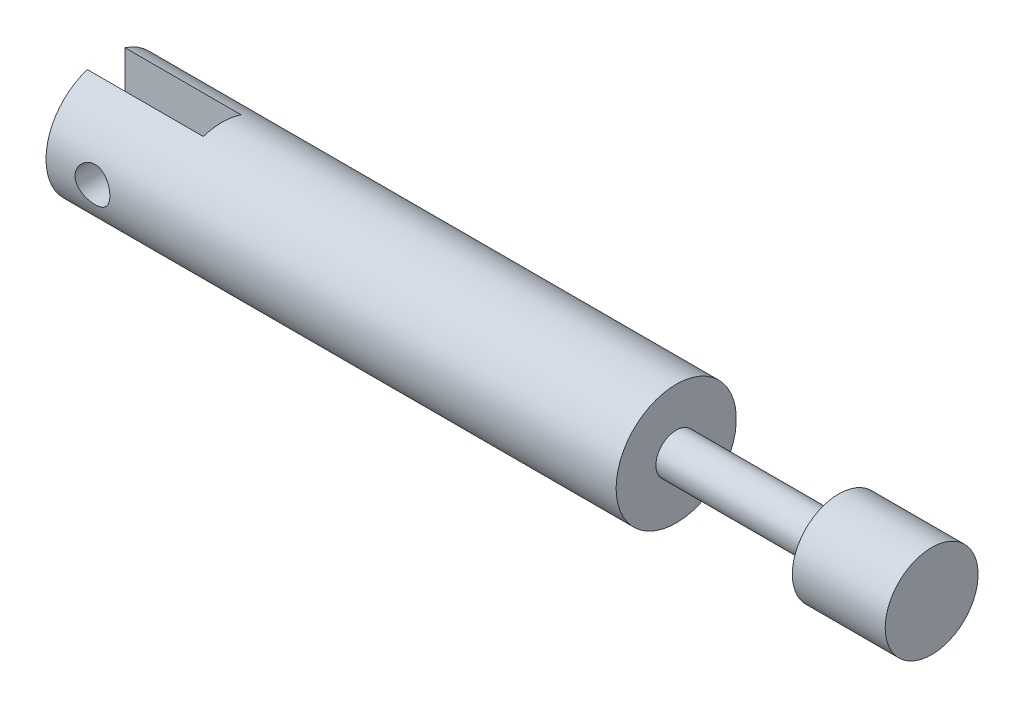
ISO-10303-21;
HEADER;
FILE_DESCRIPTION(('STEP AP214'),'2;1');
FILE_NAME('part.step','',(''),(''),'','','');
FILE_SCHEMA(('AUTOMOTIVE_DESIGN { 1 0 10303 214 1 1 1 1 }'));
ENDSEC;
DATA;
#1=APPLICATION_CONTEXT('core data for automotive mechanical design processes');
#2=APPLICATION_PROTOCOL_DEFINITION('international standard','automotive_design',2000,#1);
#3=PRODUCT_CONTEXT('',#1,'mechanical');
#4=PRODUCT('Part','Part','',(#3));
#5=PRODUCT_RELATED_PRODUCT_CATEGORY('part','',(#4));
#6=PRODUCT_DEFINITION_FORMATION('','',#4);
#7=PRODUCT_DEFINITION_CONTEXT('part definition',#1,'design');
#8=PRODUCT_DEFINITION('design','',#6,#7);
#9=PRODUCT_DEFINITION_SHAPE('','',#8);
#10=(LENGTH_UNIT() NAMED_UNIT(*) SI_UNIT(.MILLI.,.METRE.));
#11=(NAMED_UNIT(*) PLANE_ANGLE_UNIT() SI_UNIT($,.RADIAN.));
#12=(NAMED_UNIT(*) SI_UNIT($,.STERADIAN.) SOLID_ANGLE_UNIT());
#13=UNCERTAINTY_MEASURE_WITH_UNIT(LENGTH_MEASURE(1.E-05),#10,'distance_accuracy_value','');
#14=(GEOMETRIC_REPRESENTATION_CONTEXT(3) GLOBAL_UNCERTAINTY_ASSIGNED_CONTEXT((#13)) GLOBAL_UNIT_ASSIGNED_CONTEXT((#10,
#11,#12)) REPRESENTATION_CONTEXT('',''));
#15=CARTESIAN_POINT('',(0.,0.,0.));
#16=DIRECTION('',(0.,0.,1.));
#17=DIRECTION('',(1.,0.,0.));
#18=AXIS2_PLACEMENT_3D('',#15,#16,#17);
#19=CARTESIAN_POINT('',(0.,0.,0.));
#20=DIRECTION('',(-1.,0.,0.));
#21=DIRECTION('',(0.,0.,1.));
#22=AXIS2_PLACEMENT_3D('',#19,#20,#21);
#23=PLANE('',#22);
#24=DIRECTION('',(0.,1.,0.));
#25=VECTOR('',#24,1.);
#26=CARTESIAN_POINT('',(0.,-5.175,1.625));
#27=LINE('',#26,#25);
#28=CARTESIAN_POINT('',(0.,-4.9132473986153,1.625));
#29=VERTEX_POINT('',#28);
#30=CARTESIAN_POINT('',(0.,4.9132473986153,1.625));
#31=VERTEX_POINT('',#30);
#32=EDGE_CURVE('E87',#29,#31,#27,.T.);
#33=ORIENTED_EDGE('',*,*,#32,.F.);
#34=CARTESIAN_POINT('',(0.,0.,0.));
#35=DIRECTION('',(-1.,0.,0.));
#36=DIRECTION('',(0.,0.,1.));
#37=AXIS2_PLACEMENT_3D('',#34,#35,#36);
#38=CIRCLE('',#37,5.175);
#39=EDGE_CURVE('E97',#29,#31,#38,.T.);
#40=ORIENTED_EDGE('',*,*,#39,.T.);
#41=EDGE_LOOP('',(#33,#40));
#42=FACE_BOUND('',#41,.T.);
#43=ADVANCED_FACE('F39',(#42),#23,.T.);
#44=CARTESIAN_POINT('',(4.,0.,-5.176));
#45=DIRECTION('',(0.,0.,1.));
#46=DIRECTION('',(1.,0.,0.));
#47=AXIS2_PLACEMENT_3D('',#44,#45,#46);
#48=CYLINDRICAL_SURFACE('',#47,1.5);
#49=CARTESIAN_POINT('',(4.,0.,1.625));
#50=DIRECTION('',(0.,0.,1.));
#51=DIRECTION('',(1.,0.,0.));
#52=AXIS2_PLACEMENT_3D('',#49,#50,#51);
#53=CIRCLE('',#52,1.5);
#54=CARTESIAN_POINT('',(5.5,0.,1.625));
#55=VERTEX_POINT('',#54);
#56=EDGE_CURVE('E93',#55,#55,#53,.F.);
#57=ORIENTED_EDGE('',*,*,#56,.T.);
#58=EDGE_LOOP('',(#57));
#59=FACE_BOUND('',#58,.T.);
#60=CARTESIAN_POINT('',(5.5,0.,5.175));
#61=CARTESIAN_POINT('',(5.49999867064253,-0.0824154965871131,5.17499909184426));
#62=CARTESIAN_POINT('',(5.49318507603746,-0.164844567645382,5.17301221376179));
#63=CARTESIAN_POINT('',(5.46617017564822,-0.327310385248742,5.16527988452121));
#64=CARTESIAN_POINT('',(5.44596411138785,-0.407346270903968,5.15953309743981));
#65=CARTESIAN_POINT('',(5.39288969665637,-0.562658402867027,5.14491210507365));
#66=CARTESIAN_POINT('',(5.36003929545822,-0.637941220849763,5.1360423345359));
#67=CARTESIAN_POINT('',(5.28268011784121,-0.781929936432704,5.11610211912868));
#68=CARTESIAN_POINT('',(5.23817002540428,-0.850635090422284,5.10503142587722));
#69=CARTESIAN_POINT('',(5.13748852111941,-0.981372109393369,5.0815407353649));
#70=CARTESIAN_POINT('',(5.08106010451564,-1.04320133074704,5.06909449420097));
#71=CARTESIAN_POINT('',(4.95869199178577,-1.15666488929851,5.0444157083323));
#72=CARTESIAN_POINT('',(4.89275082383982,-1.20829764595798,5.03218319702496));
#73=CARTESIAN_POINT('',(4.75154522885953,-1.30094395292665,5.00904221918503));
#74=CARTESIAN_POINT('',(4.67611560887261,-1.34171467720773,4.99816652880451));
#75=CARTESIAN_POINT('',(4.51910500503525,-1.40991169385732,4.97936083632581));
#76=CARTESIAN_POINT('',(4.4375253926818,-1.43734095137048,4.97143017978582));
#77=CARTESIAN_POINT('',(4.2727966791369,-1.47735417641434,4.95968518510452));
#78=CARTESIAN_POINT('',(4.18974538814047,-1.49030984220989,4.95576800719189));
#79=CARTESIAN_POINT('',(4.02256281052005,-1.50216826635806,4.95218711827252));
#80=CARTESIAN_POINT('',(3.93843177040636,-1.50107417724412,4.95252245307182));
#81=CARTESIAN_POINT('',(3.77446113640802,-1.48515708359161,4.95731726964867));
#82=CARTESIAN_POINT('',(3.69457213298826,-1.47079458613275,4.9616384082771));
#83=CARTESIAN_POINT('',(3.53838989220457,-1.42949035599629,4.97369486587835));
#84=CARTESIAN_POINT('',(3.46209698912663,-1.40254745639973,4.98143050156566));
#85=CARTESIAN_POINT('',(3.3141230281046,-1.33649684413771,4.99955824440942));
#86=CARTESIAN_POINT('',(3.24251455275286,-1.29723600295328,5.00998347969961));
#87=CARTESIAN_POINT('',(3.10674550004671,-1.20777050964364,5.03229924738921));
#88=CARTESIAN_POINT('',(3.042586628274,-1.15756335891021,5.04419011406434));
#89=CARTESIAN_POINT('',(2.92091980953882,-1.04532197477044,5.06866311566688));
#90=CARTESIAN_POINT('',(2.86376700966082,-0.982904090964406,5.0812541607678));
#91=CARTESIAN_POINT('',(2.76066041714717,-0.849213522484772,5.10529800620264));
#92=CARTESIAN_POINT('',(2.71470723909678,-0.777940352196443,5.11675074405092));
#93=CARTESIAN_POINT('',(2.63510781346013,-0.627947255019451,5.13732064942904));
#94=CARTESIAN_POINT('',(2.60153574388517,-0.549185889999088,5.14642364467511));
#95=CARTESIAN_POINT('',(2.54821684904332,-0.386810755733824,5.161166291202));
#96=CARTESIAN_POINT('',(2.52846643348741,-0.303198252727723,5.16680684183466));
#97=CARTESIAN_POINT('',(2.50393207169015,-0.136517134970909,5.17384876861457));
#98=CARTESIAN_POINT('',(2.49866634033935,-0.0535250913676296,5.17538655528296));
#99=CARTESIAN_POINT('',(2.5019067224785,0.112159969572009,5.17444735409271));
#100=CARTESIAN_POINT('',(2.51041113087061,0.19485302266038,5.17197086330493));
#101=CARTESIAN_POINT('',(2.54055886229856,0.355805557832836,5.1633703362833));
#102=CARTESIAN_POINT('',(2.56192470475491,0.434121519438596,5.15732338269111));
#103=CARTESIAN_POINT('',(2.61685864497933,0.586043473489131,5.14227677407923));
#104=CARTESIAN_POINT('',(2.65042817102689,0.659648913443419,5.13327677345651));
#105=CARTESIAN_POINT('',(2.72965176646656,0.80186470522757,5.11301429282894));
#106=CARTESIAN_POINT('',(2.77555634859572,0.870328840433469,5.10170623586104));
#107=CARTESIAN_POINT('',(2.87783938952785,0.998748054604446,5.07812930134144));
#108=CARTESIAN_POINT('',(2.93422030079628,1.05870113535789,5.06586019920284));
#109=CARTESIAN_POINT('',(3.05811563609815,1.17048987255737,5.04122698867682));
#110=CARTESIAN_POINT('',(3.1259414832321,1.22198346080516,5.02887363794369));
#111=CARTESIAN_POINT('',(3.26953873388999,1.3128767456851,5.00591503622046));
#112=CARTESIAN_POINT('',(3.34530987800508,1.35227683699735,4.99530972818695));
#113=CARTESIAN_POINT('',(3.50235139775515,1.41758158642792,4.97717162136433));
#114=CARTESIAN_POINT('',(3.58359100780196,1.44355560662866,4.96962307542909));
#115=CARTESIAN_POINT('',(3.7495473923679,1.48138808682128,4.95847867795074));
#116=CARTESIAN_POINT('',(3.83426306592058,1.49325098104138,4.95488158474488));
#117=CARTESIAN_POINT('',(4.00123014836381,1.5022370131166,4.95216398264745));
#118=CARTESIAN_POINT('',(4.08344935154062,1.49991515095557,4.95287490702162));
#119=CARTESIAN_POINT('',(4.24627070834472,1.48191057872083,4.95829128825782));
#120=CARTESIAN_POINT('',(4.32687291881316,1.46622833914148,4.96299660445473));
#121=CARTESIAN_POINT('',(4.4833312664525,1.42229548746028,4.97576238817047));
#122=CARTESIAN_POINT('',(4.55922928582796,1.39418255489357,4.98378604124832));
#123=CARTESIAN_POINT('',(4.70529155132351,1.32629296483839,5.0022798983375));
#124=CARTESIAN_POINT('',(4.77545475537771,1.28651419356366,5.01275054566093));
#125=CARTESIAN_POINT('',(4.91065474612143,1.1948246197708,5.03540648921004));
#126=CARTESIAN_POINT('',(4.97543353153909,1.1425448486461,5.04763824104819));
#127=CARTESIAN_POINT('',(5.09547874394915,1.02801322433915,5.07220255062903));
#128=CARTESIAN_POINT('',(5.15074275076212,0.965758841765633,5.08453513318589));
#129=CARTESIAN_POINT('',(5.25165208156358,0.831044957211405,5.10830544184532));
#130=CARTESIAN_POINT('',(5.29700172467929,0.758357652161352,5.11971054962731));
#131=CARTESIAN_POINT('',(5.37477019280659,0.606059743171824,5.13996123810995));
#132=CARTESIAN_POINT('',(5.4071957975169,0.526452795910464,5.14880816011458));
#133=CARTESIAN_POINT('',(5.45486413527128,0.372839403417062,5.16205392616831));
#134=CARTESIAN_POINT('',(5.47174637539847,0.299374077147053,5.16687012746931));
#135=CARTESIAN_POINT('',(5.49431411587026,0.150609436600767,5.17334335380228));
#136=CARTESIAN_POINT('',(5.50000121475241,0.0753103857139786,5.17500082986285));
#137=CARTESIAN_POINT('',(5.5,0.,5.175));
#138=B_SPLINE_CURVE_WITH_KNOTS('',3,(#60,#61,#62,#63,#64,#65,#66,#67,#68,#69,#70,#71,#72,#73,
#74,#75,#76,#77,#78,#79,#80,#81,#82,#83,#84,#85,#86,#87,#88,#89,#90,#91,#92,#93,#94,#95,#96,#97,
#98,#99,#100,#101,#102,#103,#104,#105,#106,#107,#108,#109,#110,#111,#112,#113,#114,#115,#116,
#117,#118,#119,#120,#121,#122,#123,#124,#125,#126,#127,#128,#129,#130,#131,#132,#133,#134,#135,
#136,#137),.UNSPECIFIED.,.T.,.F.,(4,2,2,2,2,2,2,2,2,2,2,2,2,2,2,2,2,2,2,2,2,2,2,2,2,2,2,2,2,2,2,
2,2,2,2,2,2,2,4),(0.,0.246970001423545,0.49402780079284,0.740736174963613,0.987472406877195,
1.24020218510744,1.49297110789531,1.75098986511042,2.00895125135296,2.26012363976153,
2.51123967021099,2.75395494737377,2.99669274252451,3.24257637534403,3.48851619251347,
3.74400912770735,3.99951608005805,4.25652987698641,4.51347688764874,4.76176769651682,
5.01002776294126,5.2531146031601,5.49622990263737,5.74471438149983,5.99325710300631,
6.25018435747964,6.50710322605289,6.76268118410108,7.01817880903967,7.2637454442007,
7.50930343193053,7.75220726384059,7.99515513582011,8.24642680102817,8.49776228558326,
8.75579772580378,9.01369762694286,9.2394083632832,9.46508686838484),.UNSPECIFIED.);
#139=CARTESIAN_POINT('',(5.5,0.,5.175));
#140=VERTEX_POINT('',#139);
#141=EDGE_CURVE('E118',#140,#140,#138,.T.);
#142=ORIENTED_EDGE('',*,*,#141,.F.);
#143=EDGE_LOOP('',(#142));
#144=FACE_BOUND('',#143,.T.);
#145=ADVANCED_FACE('F151',(#59,#144),#48,.F.);
#146=CARTESIAN_POINT('',(49.1,0.,0.));
#147=DIRECTION('',(-1.,0.,0.));
#148=DIRECTION('',(0.,0.,1.));
#149=AXIS2_PLACEMENT_3D('',#146,#147,#148);
#150=PLANE('',#149);
#151=CARTESIAN_POINT('',(49.1,0.,0.));
#152=DIRECTION('',(-1.,0.,0.));
#153=DIRECTION('',(0.,0.,1.));
#154=AXIS2_PLACEMENT_3D('',#151,#152,#153);
#155=CIRCLE('',#154,5.175);
#156=CARTESIAN_POINT('',(49.1,0.,5.175));
#157=VERTEX_POINT('',#156);
#158=EDGE_CURVE('E96',#157,#157,#155,.T.);
#159=ORIENTED_EDGE('',*,*,#158,.F.);
#160=EDGE_LOOP('',(#159));
#161=FACE_BOUND('',#160,.T.);
#162=CARTESIAN_POINT('',(49.1,0.,0.));
#163=DIRECTION('',(-1.,0.,0.));
#164=DIRECTION('',(0.,0.,1.));
#165=AXIS2_PLACEMENT_3D('',#162,#163,#164);
#166=CIRCLE('',#165,1.75);
#167=CARTESIAN_POINT('',(49.1,0.,1.75));
#168=VERTEX_POINT('',#167);
#169=EDGE_CURVE('E176',#168,#168,#166,.T.);
#170=ORIENTED_EDGE('',*,*,#169,.T.);
#171=EDGE_LOOP('',(#170));
#172=FACE_BOUND('',#171,.T.);
#173=ADVANCED_FACE('F41',(#161,#172),#150,.F.);
#174=CARTESIAN_POINT('',(0.,0.,0.));
#175=DIRECTION('',(-1.,0.,0.));
#176=DIRECTION('',(0.,0.,1.));
#177=AXIS2_PLACEMENT_3D('',#174,#175,#176);
#178=CYLINDRICAL_SURFACE('',#177,5.175);
#179=DIRECTION('',(-1.,0.,0.));
#180=VECTOR('',#179,1.);
#181=CARTESIAN_POINT('',(0.,-4.9132473986153,1.625));
#182=LINE('',#181,#180);
#183=CARTESIAN_POINT('',(10.,-4.9132473986153,1.625));
#184=VERTEX_POINT('',#183);
#185=EDGE_CURVE('E110',#184,#29,#182,.T.);
#186=ORIENTED_EDGE('',*,*,#185,.F.);
#187=CARTESIAN_POINT('',(10.,0.,0.));
#188=DIRECTION('',(1.,0.,0.));
#189=DIRECTION('',(0.,0.,-1.));
#190=AXIS2_PLACEMENT_3D('',#187,#188,#189);
#191=CIRCLE('',#190,5.175);
#192=CARTESIAN_POINT('',(10.,-4.9132473986153,-1.625));
#193=VERTEX_POINT('',#192);
#194=EDGE_CURVE('E11',#193,#184,#191,.F.);
#195=ORIENTED_EDGE('',*,*,#194,.F.);
#196=DIRECTION('',(-1.,0.,0.));
#197=VECTOR('',#196,1.);
#198=CARTESIAN_POINT('',(0.,-4.9132473986153,-1.625));
#199=LINE('',#198,#197);
#200=CARTESIAN_POINT('',(0.,-4.9132473986153,-1.625));
#201=VERTEX_POINT('',#200);
#202=EDGE_CURVE('E81',#201,#193,#199,.F.);
#203=ORIENTED_EDGE('',*,*,#202,.F.);
#204=CARTESIAN_POINT('',(0.,4.9132473986153,-1.625));
#205=VERTEX_POINT('',#204);
#206=EDGE_CURVE('E92',#205,#201,#38,.T.);
#207=ORIENTED_EDGE('',*,*,#206,.F.);
#208=DIRECTION('',(-1.,0.,0.));
#209=VECTOR('',#208,1.);
#210=CARTESIAN_POINT('',(0.,4.9132473986153,-1.625));
#211=LINE('',#210,#209);
#212=CARTESIAN_POINT('',(10.,4.9132473986153,-1.625));
#213=VERTEX_POINT('',#212);
#214=EDGE_CURVE('E54',#213,#205,#211,.T.);
#215=ORIENTED_EDGE('',*,*,#214,.F.);
#216=CARTESIAN_POINT('',(10.,4.9132473986153,1.625));
#217=VERTEX_POINT('',#216);
#218=EDGE_CURVE('E43',#217,#213,#191,.F.);
#219=ORIENTED_EDGE('',*,*,#218,.F.);
#220=DIRECTION('',(-1.,0.,0.));
#221=VECTOR('',#220,1.);
#222=CARTESIAN_POINT('',(0.,4.9132473986153,1.625));
#223=LINE('',#222,#221);
#224=EDGE_CURVE('E113',#31,#217,#223,.F.);
#225=ORIENTED_EDGE('',*,*,#224,.F.);
#226=ORIENTED_EDGE('',*,*,#39,.F.);
#227=EDGE_LOOP('',(#186,#195,#203,#207,#215,#219,#225,#226));
#228=FACE_BOUND('',#227,.T.);
#229=ORIENTED_EDGE('',*,*,#141,.T.);
#230=EDGE_LOOP('',(#229));
#231=FACE_BOUND('',#230,.T.);
#232=CARTESIAN_POINT('',(5.5,0.,-5.175));
#233=CARTESIAN_POINT('',(5.49999867064253,0.0824154965871131,-5.17499909184426));
#234=CARTESIAN_POINT('',(5.49318507603746,0.164844567645382,-5.17301221376179));
#235=CARTESIAN_POINT('',(5.46617017564822,0.327310385248742,-5.16527988452121));
#236=CARTESIAN_POINT('',(5.44596411138785,0.407346270903968,-5.15953309743981));
#237=CARTESIAN_POINT('',(5.39288969665637,0.562658402867027,-5.14491210507365));
#238=CARTESIAN_POINT('',(5.36003929545822,0.637941220849763,-5.1360423345359));
#239=CARTESIAN_POINT('',(5.28268011784121,0.781929936432704,-5.11610211912868));
#240=CARTESIAN_POINT('',(5.23817002540428,0.850635090422284,-5.10503142587722));
#241=CARTESIAN_POINT('',(5.13748852111941,0.981372109393369,-5.0815407353649));
#242=CARTESIAN_POINT('',(5.08106010451564,1.04320133074704,-5.06909449420097));
#243=CARTESIAN_POINT('',(4.95869199178577,1.15666488929851,-5.0444157083323));
#244=CARTESIAN_POINT('',(4.89275082383982,1.20829764595798,-5.03218319702496));
#245=CARTESIAN_POINT('',(4.75154522885953,1.30094395292665,-5.00904221918503));
#246=CARTESIAN_POINT('',(4.67611560887261,1.34171467720773,-4.99816652880451));
#247=CARTESIAN_POINT('',(4.51910500503525,1.40991169385732,-4.97936083632581));
#248=CARTESIAN_POINT('',(4.4375253926818,1.43734095137048,-4.97143017978582));
#249=CARTESIAN_POINT('',(4.2727966791369,1.47735417641434,-4.95968518510452));
#250=CARTESIAN_POINT('',(4.18974538814047,1.49030984220989,-4.95576800719189));
#251=CARTESIAN_POINT('',(4.02256281052005,1.50216826635806,-4.95218711827252));
#252=CARTESIAN_POINT('',(3.93843177040636,1.50107417724412,-4.95252245307182));
#253=CARTESIAN_POINT('',(3.77446113640802,1.48515708359161,-4.95731726964867));
#254=CARTESIAN_POINT('',(3.69457213298826,1.47079458613275,-4.9616384082771));
#255=CARTESIAN_POINT('',(3.53838989220457,1.42949035599629,-4.97369486587835));
#256=CARTESIAN_POINT('',(3.46209698912663,1.40254745639973,-4.98143050156566));
#257=CARTESIAN_POINT('',(3.3141230281046,1.33649684413771,-4.99955824440942));
#258=CARTESIAN_POINT('',(3.24251455275286,1.29723600295328,-5.00998347969961));
#259=CARTESIAN_POINT('',(3.10674550004671,1.20777050964364,-5.03229924738921));
#260=CARTESIAN_POINT('',(3.042586628274,1.15756335891021,-5.04419011406434));
#261=CARTESIAN_POINT('',(2.92091980953882,1.04532197477044,-5.06866311566688));
#262=CARTESIAN_POINT('',(2.86376700966082,0.982904090964406,-5.0812541607678));
#263=CARTESIAN_POINT('',(2.76066041714717,0.849213522484772,-5.10529800620264));
#264=CARTESIAN_POINT('',(2.71470723909678,0.777940352196443,-5.11675074405092));
#265=CARTESIAN_POINT('',(2.63510781346013,0.627947255019451,-5.13732064942904));
#266=CARTESIAN_POINT('',(2.60153574388517,0.549185889999088,-5.14642364467511));
#267=CARTESIAN_POINT('',(2.54821684904332,0.386810755733824,-5.161166291202));
#268=CARTESIAN_POINT('',(2.52846643348741,0.303198252727723,-5.16680684183466));
#269=CARTESIAN_POINT('',(2.50393207169015,0.136517134970909,-5.17384876861457));
#270=CARTESIAN_POINT('',(2.49866634033935,0.0535250913676296,-5.17538655528296));
#271=CARTESIAN_POINT('',(2.5019067224785,-0.112159969572009,-5.17444735409271));
#272=CARTESIAN_POINT('',(2.51041113087061,-0.19485302266038,-5.17197086330493));
#273=CARTESIAN_POINT('',(2.54055886229856,-0.355805557832836,-5.1633703362833));
#274=CARTESIAN_POINT('',(2.56192470475491,-0.434121519438596,-5.15732338269111));
#275=CARTESIAN_POINT('',(2.61685864497933,-0.586043473489131,-5.14227677407923));
#276=CARTESIAN_POINT('',(2.65042817102689,-0.659648913443419,-5.13327677345651));
#277=CARTESIAN_POINT('',(2.72965176646656,-0.80186470522757,-5.11301429282894));
#278=CARTESIAN_POINT('',(2.77555634859572,-0.870328840433469,-5.10170623586104));
#279=CARTESIAN_POINT('',(2.87783938952785,-0.998748054604446,-5.07812930134144));
#280=CARTESIAN_POINT('',(2.93422030079628,-1.05870113535789,-5.06586019920284));
#281=CARTESIAN_POINT('',(3.05811563609815,-1.17048987255737,-5.04122698867682));
#282=CARTESIAN_POINT('',(3.1259414832321,-1.22198346080516,-5.02887363794369));
#283=CARTESIAN_POINT('',(3.26953873388999,-1.3128767456851,-5.00591503622046));
#284=CARTESIAN_POINT('',(3.34530987800508,-1.35227683699735,-4.99530972818695));
#285=CARTESIAN_POINT('',(3.50235139775515,-1.41758158642792,-4.97717162136433));
#286=CARTESIAN_POINT('',(3.58359100780196,-1.44355560662866,-4.96962307542909));
#287=CARTESIAN_POINT('',(3.7495473923679,-1.48138808682128,-4.95847867795074));
#288=CARTESIAN_POINT('',(3.83426306592058,-1.49325098104138,-4.95488158474488));
#289=CARTESIAN_POINT('',(4.00123014836381,-1.5022370131166,-4.95216398264745));
#290=CARTESIAN_POINT('',(4.08344935154062,-1.49991515095557,-4.95287490702162));
#291=CARTESIAN_POINT('',(4.24627070834472,-1.48191057872083,-4.95829128825782));
#292=CARTESIAN_POINT('',(4.32687291881316,-1.46622833914148,-4.96299660445473));
#293=CARTESIAN_POINT('',(4.4833312664525,-1.42229548746028,-4.97576238817047));
#294=CARTESIAN_POINT('',(4.55922928582796,-1.39418255489357,-4.98378604124832));
#295=CARTESIAN_POINT('',(4.70529155132351,-1.32629296483839,-5.0022798983375));
#296=CARTESIAN_POINT('',(4.77545475537771,-1.28651419356366,-5.01275054566093));
#297=CARTESIAN_POINT('',(4.91065474612143,-1.1948246197708,-5.03540648921004));
#298=CARTESIAN_POINT('',(4.97543353153909,-1.1425448486461,-5.04763824104819));
#299=CARTESIAN_POINT('',(5.09547874394915,-1.02801322433915,-5.07220255062903));
#300=CARTESIAN_POINT('',(5.15074275076212,-0.965758841765633,-5.08453513318589));
#301=CARTESIAN_POINT('',(5.25165208156358,-0.831044957211405,-5.10830544184532));
#302=CARTESIAN_POINT('',(5.29700172467929,-0.758357652161352,-5.11971054962731));
#303=CARTESIAN_POINT('',(5.37477019280659,-0.606059743171824,-5.13996123810995));
#304=CARTESIAN_POINT('',(5.4071957975169,-0.526452795910464,-5.14880816011458));
#305=CARTESIAN_POINT('',(5.45486413527128,-0.372839403417062,-5.16205392616831));
#306=CARTESIAN_POINT('',(5.47174637539847,-0.299374077147053,-5.16687012746931));
#307=CARTESIAN_POINT('',(5.49431411587026,-0.150609436600767,-5.17334335380228));
#308=CARTESIAN_POINT('',(5.50000121475241,-0.0753103857139786,-5.17500082986285));
#309=CARTESIAN_POINT('',(5.5,0.,-5.175));
#310=B_SPLINE_CURVE_WITH_KNOTS('',3,(#232,#233,#234,#235,#236,#237,#238,#239,#240,#241,#242,
#243,#244,#245,#246,#247,#248,#249,#250,#251,#252,#253,#254,#255,#256,#257,#258,#259,#260,#261,
#262,#263,#264,#265,#266,#267,#268,#269,#270,#271,#272,#273,#274,#275,#276,#277,#278,#279,#280,
#281,#282,#283,#284,#285,#286,#287,#288,#289,#290,#291,#292,#293,#294,#295,#296,#297,#298,#299,
#300,#301,#302,#303,#304,#305,#306,#307,#308,#309),.UNSPECIFIED.,.T.,.F.,(4,2,2,2,2,2,2,2,2,2,2,
2,2,2,2,2,2,2,2,2,2,2,2,2,2,2,2,2,2,2,2,2,2,2,2,2,2,2,4),(0.,0.246970001423545,0.49402780079284,
0.740736174963613,0.987472406877195,1.24020218510744,1.49297110789531,1.75098986511042,
2.00895125135296,2.26012363976153,2.51123967021099,2.75395494737377,2.99669274252451,
3.24257637534403,3.48851619251347,3.74400912770735,3.99951608005805,4.25652987698641,
4.51347688764874,4.76176769651682,5.01002776294126,5.2531146031601,5.49622990263737,
5.74471438149983,5.99325710300631,6.25018435747964,6.50710322605289,6.76268118410108,
7.01817880903967,7.2637454442007,7.50930343193053,7.75220726384059,7.99515513582011,
8.24642680102817,8.49776228558326,8.75579772580378,9.01369762694286,9.2394083632832,
9.46508686838484),.UNSPECIFIED.);
#311=CARTESIAN_POINT('',(5.5,0.,-5.175));
#312=VERTEX_POINT('',#311);
#313=EDGE_CURVE('E129',#312,#312,#310,.T.);
#314=ORIENTED_EDGE('',*,*,#313,.T.);
#315=EDGE_LOOP('',(#314));
#316=FACE_BOUND('',#315,.T.);
#317=ORIENTED_EDGE('',*,*,#158,.T.);
#318=EDGE_LOOP('',(#317));
#319=FACE_BOUND('',#318,.T.);
#320=ADVANCED_FACE('F90',(#228,#231,#316,#319),#178,.T.);
#321=DIRECTION('',(0.,-1.,0.));
#322=VECTOR('',#321,1.);
#323=CARTESIAN_POINT('',(0.,-5.175,-1.625));
#324=LINE('',#323,#322);
#325=EDGE_CURVE('E77',#205,#201,#324,.T.);
#326=ORIENTED_EDGE('',*,*,#325,.F.);
#327=ORIENTED_EDGE('',*,*,#206,.T.);
#328=EDGE_LOOP('',(#326,#327));
#329=FACE_BOUND('',#328,.T.);
#330=ADVANCED_FACE('F95',(#329),#23,.T.);
#331=CARTESIAN_POINT('',(71.1,0.,0.));
#332=DIRECTION('',(-1.,0.,0.));
#333=DIRECTION('',(0.,0.,1.));
#334=AXIS2_PLACEMENT_3D('',#331,#332,#333);
#335=PLANE('',#334);
#336=CARTESIAN_POINT('',(71.1,0.,0.));
#337=DIRECTION('',(-1.,0.,0.));
#338=DIRECTION('',(0.,0.,1.));
#339=AXIS2_PLACEMENT_3D('',#336,#337,#338);
#340=CIRCLE('',#339,4.);
#341=CARTESIAN_POINT('',(71.1,0.,4.));
#342=VERTEX_POINT('',#341);
#343=EDGE_CURVE('E102',#342,#342,#340,.T.);
#344=ORIENTED_EDGE('',*,*,#343,.F.);
#345=EDGE_LOOP('',(#344));
#346=FACE_BOUND('',#345,.T.);
#347=ADVANCED_FACE('F159',(#346),#335,.F.);
#348=CARTESIAN_POINT('',(0.,0.,0.));
#349=DIRECTION('',(-1.,0.,0.));
#350=DIRECTION('',(0.,0.,1.));
#351=AXIS2_PLACEMENT_3D('',#348,#349,#350);
#352=CYLINDRICAL_SURFACE('',#351,4.);
#353=CARTESIAN_POINT('',(63.1,0.,0.));
#354=DIRECTION('',(-1.,0.,0.));
#355=DIRECTION('',(0.,0.,1.));
#356=AXIS2_PLACEMENT_3D('',#353,#354,#355);
#357=CIRCLE('',#356,4.);
#358=CARTESIAN_POINT('',(63.1,0.,4.));
#359=VERTEX_POINT('',#358);
#360=EDGE_CURVE('E180',#359,#359,#357,.T.);
#361=ORIENTED_EDGE('',*,*,#360,.F.);
#362=EDGE_LOOP('',(#361));
#363=FACE_BOUND('',#362,.T.);
#364=ORIENTED_EDGE('',*,*,#343,.T.);
#365=EDGE_LOOP('',(#364));
#366=FACE_BOUND('',#365,.T.);
#367=ADVANCED_FACE('F164',(#363,#366),#352,.T.);
#368=CARTESIAN_POINT('',(63.1,0.,0.));
#369=DIRECTION('',(-1.,0.,0.));
#370=DIRECTION('',(0.,0.,1.));
#371=AXIS2_PLACEMENT_3D('',#368,#369,#370);
#372=PLANE('',#371);
#373=ORIENTED_EDGE('',*,*,#360,.T.);
#374=EDGE_LOOP('',(#373));
#375=FACE_BOUND('',#374,.T.);
#376=CARTESIAN_POINT('',(63.1,0.,0.));
#377=DIRECTION('',(-1.,0.,0.));
#378=DIRECTION('',(0.,0.,1.));
#379=AXIS2_PLACEMENT_3D('',#376,#377,#378);
#380=CIRCLE('',#379,1.75);
#381=CARTESIAN_POINT('',(63.1,0.,1.75));
#382=VERTEX_POINT('',#381);
#383=EDGE_CURVE('E178',#382,#382,#380,.T.);
#384=ORIENTED_EDGE('',*,*,#383,.F.);
#385=EDGE_LOOP('',(#384));
#386=FACE_BOUND('',#385,.T.);
#387=ADVANCED_FACE('F190',(#375,#386),#372,.T.);
#388=CARTESIAN_POINT('',(0.,0.,0.));
#389=DIRECTION('',(-1.,0.,0.));
#390=DIRECTION('',(0.,0.,1.));
#391=AXIS2_PLACEMENT_3D('',#388,#389,#390);
#392=CYLINDRICAL_SURFACE('',#391,1.75);
#393=ORIENTED_EDGE('',*,*,#169,.F.);
#394=EDGE_LOOP('',(#393));
#395=FACE_BOUND('',#394,.T.);
#396=ORIENTED_EDGE('',*,*,#383,.T.);
#397=EDGE_LOOP('',(#396));
#398=FACE_BOUND('',#397,.T.);
#399=ADVANCED_FACE('F196',(#395,#398),#392,.T.);
#400=CARTESIAN_POINT('',(4.,0.,-1.625));
#401=DIRECTION('',(0.,0.,-1.));
#402=DIRECTION('',(-1.,0.,0.));
#403=AXIS2_PLACEMENT_3D('',#400,#401,#402);
#404=CIRCLE('',#403,1.5);
#405=CARTESIAN_POINT('',(2.5,0.,-1.625));
#406=VERTEX_POINT('',#405);
#407=EDGE_CURVE('E106',#406,#406,#404,.F.);
#408=ORIENTED_EDGE('',*,*,#407,.T.);
#409=EDGE_LOOP('',(#408));
#410=FACE_BOUND('',#409,.T.);
#411=ORIENTED_EDGE('',*,*,#313,.F.);
#412=EDGE_LOOP('',(#411));
#413=FACE_BOUND('',#412,.T.);
#414=ADVANCED_FACE('F134',(#410,#413),#48,.F.);
#415=CARTESIAN_POINT('',(10.,-5.175,1.625));
#416=DIRECTION('',(0.,0.,1.));
#417=DIRECTION('',(1.,0.,0.));
#418=AXIS2_PLACEMENT_3D('',#415,#416,#417);
#419=PLANE('',#418);
#420=ORIENTED_EDGE('',*,*,#224,.T.);
#421=DIRECTION('',(0.,1.,0.));
#422=VECTOR('',#421,1.);
#423=CARTESIAN_POINT('',(10.,-5.175,1.625));
#424=LINE('',#423,#422);
#425=EDGE_CURVE('E86',#184,#217,#424,.T.);
#426=ORIENTED_EDGE('',*,*,#425,.F.);
#427=ORIENTED_EDGE('',*,*,#185,.T.);
#428=ORIENTED_EDGE('',*,*,#32,.T.);
#429=EDGE_LOOP('',(#420,#426,#427,#428));
#430=FACE_BOUND('',#429,.T.);
#431=ORIENTED_EDGE('',*,*,#56,.F.);
#432=EDGE_LOOP('',(#431));
#433=FACE_BOUND('',#432,.T.);
#434=ADVANCED_FACE('F139',(#430,#433),#419,.F.);
#435=CARTESIAN_POINT('',(10.,-5.175,-1.625));
#436=DIRECTION('',(0.,0.,-1.));
#437=DIRECTION('',(-1.,0.,0.));
#438=AXIS2_PLACEMENT_3D('',#435,#436,#437);
#439=PLANE('',#438);
#440=ORIENTED_EDGE('',*,*,#202,.T.);
#441=DIRECTION('',(0.,-1.,0.));
#442=VECTOR('',#441,1.);
#443=CARTESIAN_POINT('',(10.,-5.175,-1.625));
#444=LINE('',#443,#442);
#445=EDGE_CURVE('E108',#213,#193,#444,.T.);
#446=ORIENTED_EDGE('',*,*,#445,.F.);
#447=ORIENTED_EDGE('',*,*,#214,.T.);
#448=ORIENTED_EDGE('',*,*,#325,.T.);
#449=EDGE_LOOP('',(#440,#446,#447,#448));
#450=FACE_BOUND('',#449,.T.);
#451=ORIENTED_EDGE('',*,*,#407,.F.);
#452=EDGE_LOOP('',(#451));
#453=FACE_BOUND('',#452,.T.);
#454=ADVANCED_FACE('F79',(#450,#453),#439,.F.);
#455=CARTESIAN_POINT('',(10.,0.,0.));
#456=DIRECTION('',(1.,0.,0.));
#457=DIRECTION('',(0.,0.,-1.));
#458=AXIS2_PLACEMENT_3D('',#455,#456,#457);
#459=PLANE('',#458);
#460=ORIENTED_EDGE('',*,*,#445,.T.);
#461=ORIENTED_EDGE('',*,*,#194,.T.);
#462=ORIENTED_EDGE('',*,*,#425,.T.);
#463=ORIENTED_EDGE('',*,*,#218,.T.);
#464=EDGE_LOOP('',(#460,#461,#462,#463));
#465=FACE_BOUND('',#464,.T.);
#466=ADVANCED_FACE('F145',(#465),#459,.F.);
#467=CLOSED_SHELL('',(#43,#145,#173,#320,#330,#347,#367,#387,#399,#414,#434,#454,#466));
#468=MANIFOLD_SOLID_BREP('B2',#467);
#469=ADVANCED_BREP_SHAPE_REPRESENTATION('',(#18,#468),#14);
#470=SHAPE_DEFINITION_REPRESENTATION(#9,#469);
ENDSEC;
END-ISO-10303-21;
